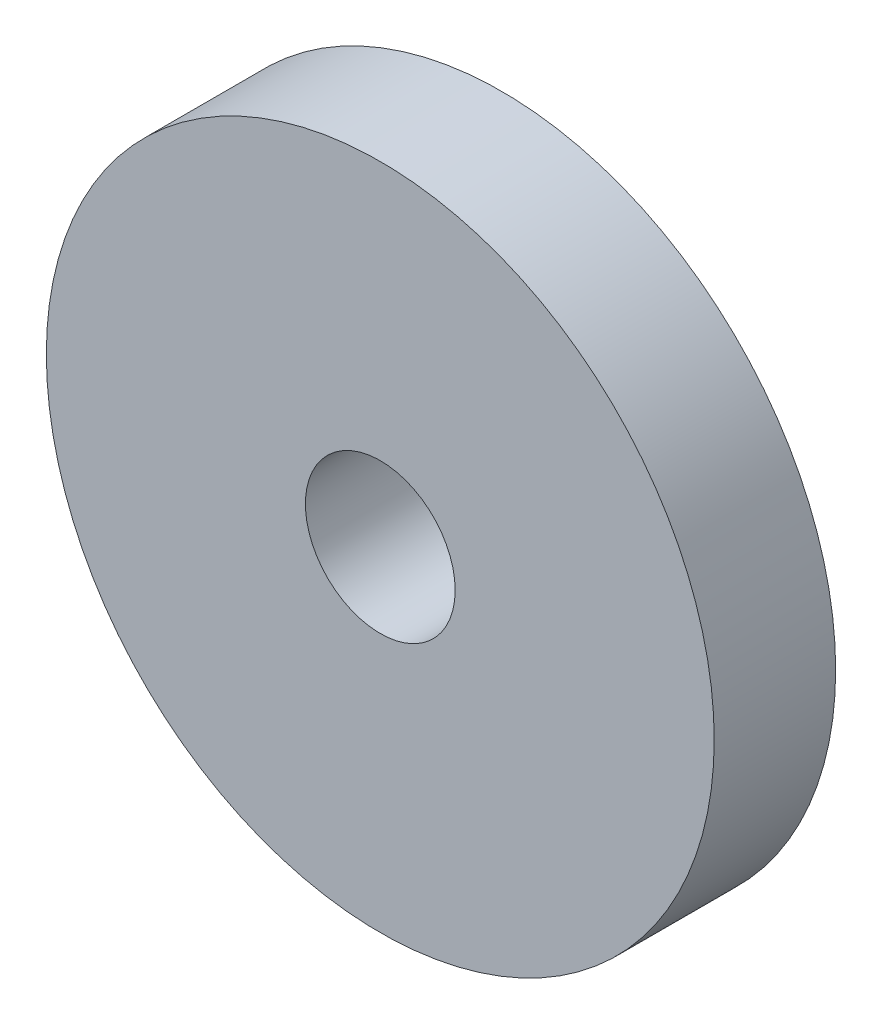
ISO-10303-21;
HEADER;
FILE_DESCRIPTION(('STEP AP214'),'2;1');
FILE_NAME('part.step','',(''),(''),'','','');
FILE_SCHEMA(('AUTOMOTIVE_DESIGN { 1 0 10303 214 1 1 1 1 }'));
ENDSEC;
DATA;
#1=APPLICATION_CONTEXT('core data for automotive mechanical design processes');
#2=APPLICATION_PROTOCOL_DEFINITION('international standard','automotive_design',2000,#1);
#3=PRODUCT_CONTEXT('',#1,'mechanical');
#4=PRODUCT('Part','Part','',(#3));
#5=PRODUCT_RELATED_PRODUCT_CATEGORY('part','',(#4));
#6=PRODUCT_DEFINITION_FORMATION('','',#4);
#7=PRODUCT_DEFINITION_CONTEXT('part definition',#1,'design');
#8=PRODUCT_DEFINITION('design','',#6,#7);
#9=PRODUCT_DEFINITION_SHAPE('','',#8);
#10=(LENGTH_UNIT() NAMED_UNIT(*) SI_UNIT(.MILLI.,.METRE.));
#11=(NAMED_UNIT(*) PLANE_ANGLE_UNIT() SI_UNIT($,.RADIAN.));
#12=(NAMED_UNIT(*) SI_UNIT($,.STERADIAN.) SOLID_ANGLE_UNIT());
#13=UNCERTAINTY_MEASURE_WITH_UNIT(LENGTH_MEASURE(1.E-05),#10,'distance_accuracy_value','');
#14=(GEOMETRIC_REPRESENTATION_CONTEXT(3) GLOBAL_UNCERTAINTY_ASSIGNED_CONTEXT((#13)) GLOBAL_UNIT_ASSIGNED_CONTEXT((#10,
#11,#12)) REPRESENTATION_CONTEXT('',''));
#15=CARTESIAN_POINT('',(0.,0.,0.));
#16=DIRECTION('',(0.,0.,1.));
#17=DIRECTION('',(1.,0.,0.));
#18=AXIS2_PLACEMENT_3D('',#15,#16,#17);
#19=CARTESIAN_POINT('',(0.,0.,3.));
#20=DIRECTION('',(0.,0.,1.));
#21=DIRECTION('',(1.,0.,0.));
#22=AXIS2_PLACEMENT_3D('',#19,#20,#21);
#23=PLANE('',#22);
#24=CARTESIAN_POINT('',(0.,0.,3.));
#25=DIRECTION('',(0.,0.,1.));
#26=DIRECTION('',(1.,0.,0.));
#27=AXIS2_PLACEMENT_3D('',#24,#25,#26);
#28=CIRCLE('',#27,8.25);
#29=CARTESIAN_POINT('',(8.25,0.,3.));
#30=VERTEX_POINT('',#29);
#31=EDGE_CURVE('E10',#30,#30,#28,.T.);
#32=ORIENTED_EDGE('',*,*,#31,.T.);
#33=EDGE_LOOP('',(#32));
#34=FACE_BOUND('',#33,.T.);
#35=CARTESIAN_POINT('',(0.,0.,3.));
#36=DIRECTION('',(0.,0.,1.));
#37=DIRECTION('',(1.,0.,0.));
#38=AXIS2_PLACEMENT_3D('',#35,#36,#37);
#39=CIRCLE('',#38,1.85);
#40=CARTESIAN_POINT('',(1.85,0.,3.));
#41=VERTEX_POINT('',#40);
#42=EDGE_CURVE('E45',#41,#41,#39,.T.);
#43=ORIENTED_EDGE('',*,*,#42,.F.);
#44=EDGE_LOOP('',(#43));
#45=FACE_BOUND('',#44,.T.);
#46=ADVANCED_FACE('F34',(#34,#45),#23,.T.);
#47=CARTESIAN_POINT('',(0.,0.,0.));
#48=DIRECTION('',(0.,0.,1.));
#49=DIRECTION('',(1.,0.,0.));
#50=AXIS2_PLACEMENT_3D('',#47,#48,#49);
#51=PLANE('',#50);
#52=CARTESIAN_POINT('',(0.,0.,0.));
#53=DIRECTION('',(0.,0.,1.));
#54=DIRECTION('',(1.,0.,0.));
#55=AXIS2_PLACEMENT_3D('',#52,#53,#54);
#56=CIRCLE('',#55,8.25);
#57=CARTESIAN_POINT('',(8.25,0.,0.));
#58=VERTEX_POINT('',#57);
#59=EDGE_CURVE('E38',#58,#58,#56,.T.);
#60=ORIENTED_EDGE('',*,*,#59,.F.);
#61=EDGE_LOOP('',(#60));
#62=FACE_BOUND('',#61,.T.);
#63=CARTESIAN_POINT('',(0.,0.,0.));
#64=DIRECTION('',(0.,0.,1.));
#65=DIRECTION('',(1.,0.,0.));
#66=AXIS2_PLACEMENT_3D('',#63,#64,#65);
#67=CIRCLE('',#66,1.85);
#68=CARTESIAN_POINT('',(1.85,0.,0.));
#69=VERTEX_POINT('',#68);
#70=EDGE_CURVE('E47',#69,#69,#67,.T.);
#71=ORIENTED_EDGE('',*,*,#70,.T.);
#72=EDGE_LOOP('',(#71));
#73=FACE_BOUND('',#72,.T.);
#74=ADVANCED_FACE('F57',(#62,#73),#51,.F.);
#75=CARTESIAN_POINT('',(0.,0.,3.));
#76=DIRECTION('',(0.,0.,-1.));
#77=DIRECTION('',(-1.,0.,0.));
#78=AXIS2_PLACEMENT_3D('',#75,#76,#77);
#79=CYLINDRICAL_SURFACE('',#78,8.25);
#80=ORIENTED_EDGE('',*,*,#31,.F.);
#81=EDGE_LOOP('',(#80));
#82=FACE_BOUND('',#81,.T.);
#83=ORIENTED_EDGE('',*,*,#59,.T.);
#84=EDGE_LOOP('',(#83));
#85=FACE_BOUND('',#84,.T.);
#86=ADVANCED_FACE('F36',(#82,#85),#79,.T.);
#87=CARTESIAN_POINT('',(0.,0.,3.));
#88=DIRECTION('',(0.,0.,-1.));
#89=DIRECTION('',(-1.,0.,0.));
#90=AXIS2_PLACEMENT_3D('',#87,#88,#89);
#91=CYLINDRICAL_SURFACE('',#90,1.85);
#92=ORIENTED_EDGE('',*,*,#42,.T.);
#93=EDGE_LOOP('',(#92));
#94=FACE_BOUND('',#93,.T.);
#95=ORIENTED_EDGE('',*,*,#70,.F.);
#96=EDGE_LOOP('',(#95));
#97=FACE_BOUND('',#96,.T.);
#98=ADVANCED_FACE('F53',(#94,#97),#91,.F.);
#99=CLOSED_SHELL('',(#46,#74,#86,#98));
#100=MANIFOLD_SOLID_BREP('B2',#99);
#101=ADVANCED_BREP_SHAPE_REPRESENTATION('',(#18,#100),#14);
#102=SHAPE_DEFINITION_REPRESENTATION(#9,#101);
ENDSEC;
END-ISO-10303-21;
